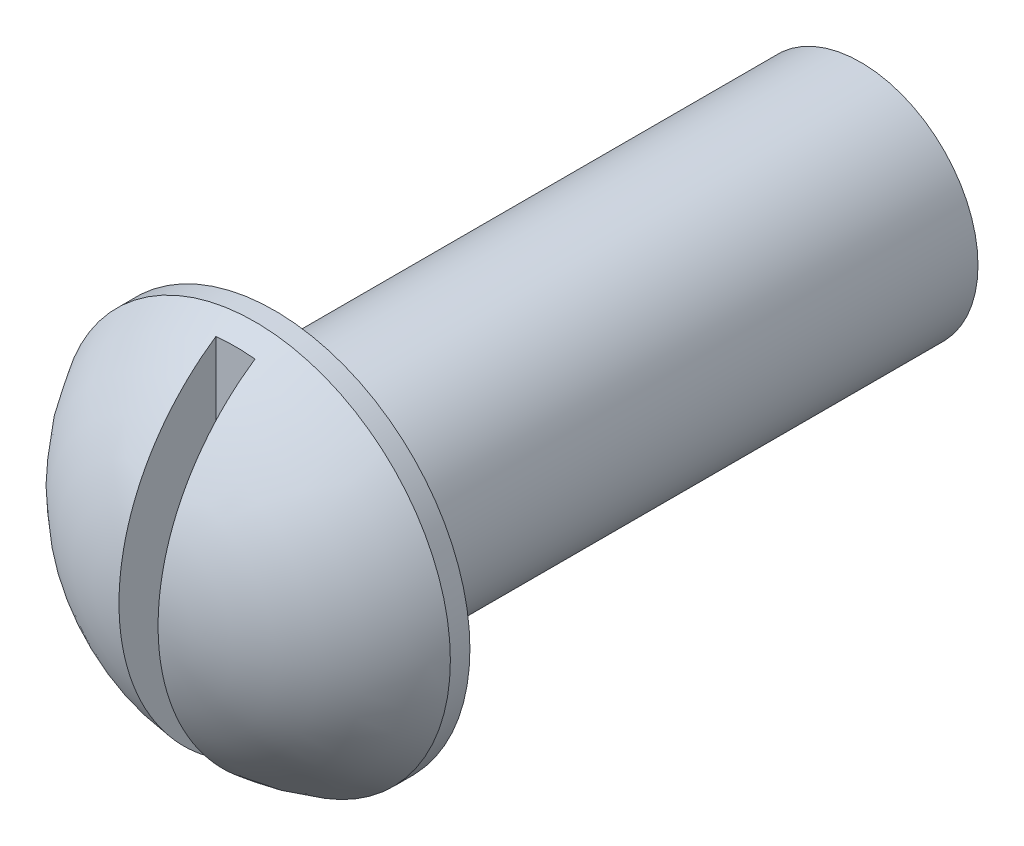
ISO-10303-21;
HEADER;
FILE_DESCRIPTION(('STEP AP214'),'2;1');
FILE_NAME('part.step','',(''),(''),'','','');
FILE_SCHEMA(('AUTOMOTIVE_DESIGN { 1 0 10303 214 1 1 1 1 }'));
ENDSEC;
DATA;
#1=APPLICATION_CONTEXT('core data for automotive mechanical design processes');
#2=APPLICATION_PROTOCOL_DEFINITION('international standard','automotive_design',2000,#1);
#3=PRODUCT_CONTEXT('',#1,'mechanical');
#4=PRODUCT('Part','Part','',(#3));
#5=PRODUCT_RELATED_PRODUCT_CATEGORY('part','',(#4));
#6=PRODUCT_DEFINITION_FORMATION('','',#4);
#7=PRODUCT_DEFINITION_CONTEXT('part definition',#1,'design');
#8=PRODUCT_DEFINITION('design','',#6,#7);
#9=PRODUCT_DEFINITION_SHAPE('','',#8);
#10=(LENGTH_UNIT() NAMED_UNIT(*) SI_UNIT(.MILLI.,.METRE.));
#11=(NAMED_UNIT(*) PLANE_ANGLE_UNIT() SI_UNIT($,.RADIAN.));
#12=(NAMED_UNIT(*) SI_UNIT($,.STERADIAN.) SOLID_ANGLE_UNIT());
#13=UNCERTAINTY_MEASURE_WITH_UNIT(LENGTH_MEASURE(1.E-05),#10,'distance_accuracy_value','');
#14=(GEOMETRIC_REPRESENTATION_CONTEXT(3) GLOBAL_UNCERTAINTY_ASSIGNED_CONTEXT((#13)) GLOBAL_UNIT_ASSIGNED_CONTEXT((#10,
#11,#12)) REPRESENTATION_CONTEXT('',''));
#15=CARTESIAN_POINT('',(0.,0.,0.));
#16=DIRECTION('',(0.,0.,1.));
#17=DIRECTION('',(1.,0.,0.));
#18=AXIS2_PLACEMENT_3D('',#15,#16,#17);
#19=CARTESIAN_POINT('',(-0.75,-2.383195552535,1.5));
#20=DIRECTION('',(0.,0.,-1.));
#21=DIRECTION('',(-1.,0.,0.));
#22=AXIS2_PLACEMENT_3D('',#19,#20,#21);
#23=CYLINDRICAL_SURFACE('',#22,0.299999999999997);
#24=CARTESIAN_POINT('',(-0.75,-2.383195552535,1.5));
#25=DIRECTION('',(0.,0.,1.));
#26=DIRECTION('',(1.,0.,0.));
#27=AXIS2_PLACEMENT_3D('',#24,#25,#26);
#28=CIRCLE('',#27,0.299999999999997);
#29=CARTESIAN_POINT('',(-0.450000000000003,-2.383195552535,1.5));
#30=VERTEX_POINT('',#29);
#31=EDGE_CURVE('E94',#30,#30,#28,.T.);
#32=ORIENTED_EDGE('',*,*,#31,.F.);
#33=EDGE_LOOP('',(#32));
#34=FACE_BOUND('',#33,.T.);
#35=CARTESIAN_POINT('',(-0.75,-2.383195552535,0.));
#36=DIRECTION('',(0.,0.,1.));
#37=DIRECTION('',(1.,0.,0.));
#38=AXIS2_PLACEMENT_3D('',#35,#36,#37);
#39=CIRCLE('',#38,0.299999999999997);
#40=CARTESIAN_POINT('',(-0.450000000000003,-2.383195552535,0.));
#41=VERTEX_POINT('',#40);
#42=EDGE_CURVE('E105',#41,#41,#39,.T.);
#43=ORIENTED_EDGE('',*,*,#42,.T.);
#44=EDGE_LOOP('',(#43));
#45=FACE_BOUND('',#44,.T.);
#46=ADVANCED_FACE('F63',(#34,#45),#23,.T.);
#47=CARTESIAN_POINT('',(-0.75,-2.383195552535,0.));
#48=DIRECTION('',(0.,0.,1.));
#49=DIRECTION('',(1.,0.,0.));
#50=AXIS2_PLACEMENT_3D('',#47,#48,#49);
#51=PLANE('',#50);
#52=ORIENTED_EDGE('',*,*,#42,.F.);
#53=EDGE_LOOP('',(#52));
#54=FACE_BOUND('',#53,.T.);
#55=ADVANCED_FACE('F124',(#54),#51,.F.);
#56=CARTESIAN_POINT('',(-0.75,-3.62461690877231,1.5));
#57=DIRECTION('',(0.,0.,1.));
#58=DIRECTION('',(1.,0.,0.));
#59=AXIS2_PLACEMENT_3D('',#56,#57,#58);
#60=PLANE('',#59);
#61=CARTESIAN_POINT('',(-0.75,-2.383195552535,1.5));
#62=DIRECTION('',(0.,0.,1.));
#63=DIRECTION('',(1.,0.,0.));
#64=AXIS2_PLACEMENT_3D('',#61,#62,#63);
#65=CIRCLE('',#64,0.5);
#66=CARTESIAN_POINT('',(-0.25,-2.383195552535,1.5));
#67=VERTEX_POINT('',#66);
#68=EDGE_CURVE('E106',#67,#67,#65,.T.);
#69=ORIENTED_EDGE('',*,*,#68,.F.);
#70=EDGE_LOOP('',(#69));
#71=FACE_BOUND('',#70,.T.);
#72=ORIENTED_EDGE('',*,*,#31,.T.);
#73=EDGE_LOOP('',(#72));
#74=FACE_BOUND('',#73,.T.);
#75=ADVANCED_FACE('F129',(#71,#74),#60,.F.);
#76=CARTESIAN_POINT('',(-0.75,-2.383195552535,1.55));
#77=DIRECTION('',(0.,0.,-1.));
#78=DIRECTION('',(-1.,0.,0.));
#79=AXIS2_PLACEMENT_3D('',#76,#77,#78);
#80=CYLINDRICAL_SURFACE('',#79,0.5);
#81=CARTESIAN_POINT('',(-0.75,-2.383195552535,1.55));
#82=DIRECTION('',(0.,0.,1.));
#83=DIRECTION('',(1.,0.,0.));
#84=AXIS2_PLACEMENT_3D('',#81,#82,#83);
#85=CIRCLE('',#84,0.5);
#86=CARTESIAN_POINT('',(-0.25,-2.383195552535,1.55));
#87=VERTEX_POINT('',#86);
#88=EDGE_CURVE('E102',#87,#87,#85,.T.);
#89=ORIENTED_EDGE('',*,*,#88,.F.);
#90=EDGE_LOOP('',(#89));
#91=FACE_BOUND('',#90,.T.);
#92=ORIENTED_EDGE('',*,*,#68,.T.);
#93=EDGE_LOOP('',(#92));
#94=FACE_BOUND('',#93,.T.);
#95=ADVANCED_FACE('F135',(#91,#94),#80,.T.);
#96=CARTESIAN_POINT('',(-0.75,-2.383195552535,1.28333333333333));
#97=DIRECTION('',(0.,0.,1.));
#98=DIRECTION('',(1.,0.,0.));
#99=AXIS2_PLACEMENT_3D('',#96,#97,#98);
#100=SPHERICAL_SURFACE('',#99,0.566666666666667);
#101=CARTESIAN_POINT('',(-0.7,-2.383195552535,1.28333333333333));
#102=DIRECTION('',(1.,0.,0.));
#103=DIRECTION('',(0.,0.,-1.));
#104=AXIS2_PLACEMENT_3D('',#101,#102,#103);
#105=CIRCLE('',#104,0.564456474062537);
#106=CARTESIAN_POINT('',(-0.7,-2.85045707816421,1.6));
#107=VERTEX_POINT('',#106);
#108=CARTESIAN_POINT('',(-0.7,-1.9159340269058,1.6));
#109=VERTEX_POINT('',#108);
#110=EDGE_CURVE('E12',#107,#109,#105,.F.);
#111=ORIENTED_EDGE('',*,*,#110,.F.);
#112=CARTESIAN_POINT('',(-0.75,-2.383195552535,1.6));
#113=DIRECTION('',(0.,0.,-1.));
#114=DIRECTION('',(-1.,0.,0.));
#115=AXIS2_PLACEMENT_3D('',#112,#113,#114);
#116=CIRCLE('',#115,0.469929072662389);
#117=CARTESIAN_POINT('',(-0.8,-2.85045707816421,1.6));
#118=VERTEX_POINT('',#117);
#119=EDGE_CURVE('E71',#118,#107,#116,.F.);
#120=ORIENTED_EDGE('',*,*,#119,.F.);
#121=CARTESIAN_POINT('',(-0.8,-2.383195552535,1.28333333333333));
#122=DIRECTION('',(-1.,0.,0.));
#123=DIRECTION('',(0.,0.,1.));
#124=AXIS2_PLACEMENT_3D('',#121,#122,#123);
#125=CIRCLE('',#124,0.564456474062537);
#126=CARTESIAN_POINT('',(-0.8,-1.9159340269058,1.6));
#127=VERTEX_POINT('',#126);
#128=EDGE_CURVE('E89',#127,#118,#125,.F.);
#129=ORIENTED_EDGE('',*,*,#128,.F.);
#130=EDGE_CURVE('E93',#109,#127,#116,.F.);
#131=ORIENTED_EDGE('',*,*,#130,.F.);
#132=EDGE_LOOP('',(#111,#120,#129,#131));
#133=FACE_BOUND('',#132,.T.);
#134=ORIENTED_EDGE('',*,*,#88,.T.);
#135=EDGE_LOOP('',(#134));
#136=FACE_BOUND('',#135,.T.);
#137=ADVANCED_FACE('F65',(#133,#136),#100,.T.);
#138=CARTESIAN_POINT('',(-1.97272933259531,-2.31747378242986,1.6));
#139=DIRECTION('',(0.,0.,-1.));
#140=DIRECTION('',(-1.,0.,0.));
#141=AXIS2_PLACEMENT_3D('',#138,#139,#140);
#142=PLANE('',#141);
#143=ORIENTED_EDGE('',*,*,#119,.T.);
#144=DIRECTION('',(0.,-1.,0.));
#145=VECTOR('',#144,1.);
#146=CARTESIAN_POINT('',(-0.7,-2.31747378242986,1.6));
#147=LINE('',#146,#145);
#148=EDGE_CURVE('E97',#109,#107,#147,.T.);
#149=ORIENTED_EDGE('',*,*,#148,.F.);
#150=ORIENTED_EDGE('',*,*,#130,.T.);
#151=DIRECTION('',(0.,1.,0.));
#152=VECTOR('',#151,1.);
#153=CARTESIAN_POINT('',(-0.8,-2.383195552535,1.6));
#154=LINE('',#153,#152);
#155=EDGE_CURVE('E77',#118,#127,#154,.T.);
#156=ORIENTED_EDGE('',*,*,#155,.F.);
#157=EDGE_LOOP('',(#143,#149,#150,#156));
#158=FACE_BOUND('',#157,.T.);
#159=ADVANCED_FACE('F96',(#158),#142,.F.);
#160=CARTESIAN_POINT('',(-0.7,-2.31747378242986,4.72));
#161=DIRECTION('',(1.,0.,0.));
#162=DIRECTION('',(0.,0.,-1.));
#163=AXIS2_PLACEMENT_3D('',#160,#161,#162);
#164=PLANE('',#163);
#165=ORIENTED_EDGE('',*,*,#110,.T.);
#166=ORIENTED_EDGE('',*,*,#148,.T.);
#167=EDGE_LOOP('',(#165,#166));
#168=FACE_BOUND('',#167,.T.);
#169=ADVANCED_FACE('F114',(#168),#164,.F.);
#170=CARTESIAN_POINT('',(-0.8,-2.383195552535,4.72));
#171=DIRECTION('',(-1.,0.,0.));
#172=DIRECTION('',(0.,0.,1.));
#173=AXIS2_PLACEMENT_3D('',#170,#171,#172);
#174=PLANE('',#173);
#175=ORIENTED_EDGE('',*,*,#128,.T.);
#176=ORIENTED_EDGE('',*,*,#155,.T.);
#177=EDGE_LOOP('',(#175,#176));
#178=FACE_BOUND('',#177,.T.);
#179=ADVANCED_FACE('F90',(#178),#174,.F.);
#180=CLOSED_SHELL('',(#46,#55,#75,#95,#137,#159,#169,#179));
#181=MANIFOLD_SOLID_BREP('B2',#180);
#182=ADVANCED_BREP_SHAPE_REPRESENTATION('',(#18,#181),#14);
#183=SHAPE_DEFINITION_REPRESENTATION(#9,#182);
ENDSEC;
END-ISO-10303-21;
